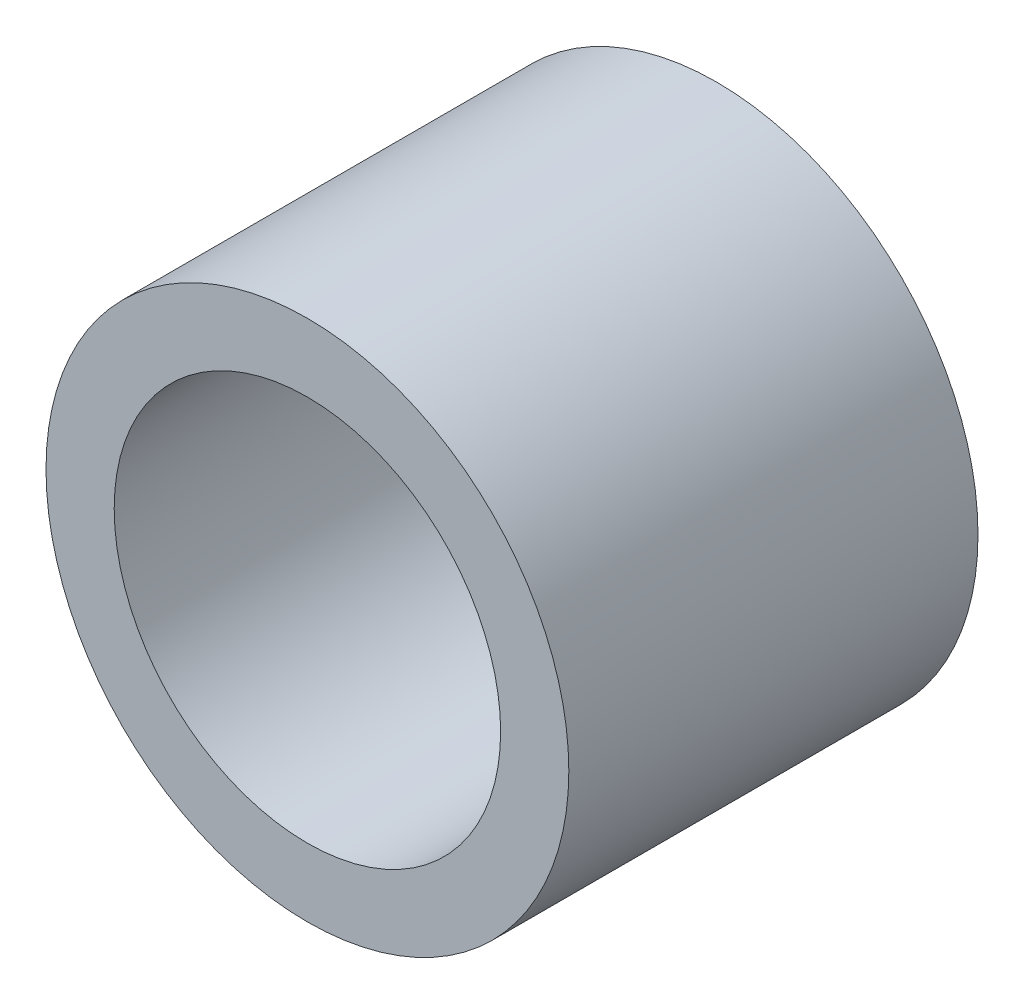
ISO-10303-21;
HEADER;
FILE_DESCRIPTION(('STEP AP214'),'2;1');
FILE_NAME('part.step','',(''),(''),'','','');
FILE_SCHEMA(('AUTOMOTIVE_DESIGN { 1 0 10303 214 1 1 1 1 }'));
ENDSEC;
DATA;
#1=APPLICATION_CONTEXT('core data for automotive mechanical design processes');
#2=APPLICATION_PROTOCOL_DEFINITION('international standard','automotive_design',2000,#1);
#3=PRODUCT_CONTEXT('',#1,'mechanical');
#4=PRODUCT('Part','Part','',(#3));
#5=PRODUCT_RELATED_PRODUCT_CATEGORY('part','',(#4));
#6=PRODUCT_DEFINITION_FORMATION('','',#4);
#7=PRODUCT_DEFINITION_CONTEXT('part definition',#1,'design');
#8=PRODUCT_DEFINITION('design','',#6,#7);
#9=PRODUCT_DEFINITION_SHAPE('','',#8);
#10=(LENGTH_UNIT() NAMED_UNIT(*) SI_UNIT(.MILLI.,.METRE.));
#11=(NAMED_UNIT(*) PLANE_ANGLE_UNIT() SI_UNIT($,.RADIAN.));
#12=(NAMED_UNIT(*) SI_UNIT($,.STERADIAN.) SOLID_ANGLE_UNIT());
#13=UNCERTAINTY_MEASURE_WITH_UNIT(LENGTH_MEASURE(1.E-05),#10,'distance_accuracy_value','');
#14=(GEOMETRIC_REPRESENTATION_CONTEXT(3) GLOBAL_UNCERTAINTY_ASSIGNED_CONTEXT((#13)) GLOBAL_UNIT_ASSIGNED_CONTEXT((#10,
#11,#12)) REPRESENTATION_CONTEXT('',''));
#15=CARTESIAN_POINT('',(0.,0.,0.));
#16=DIRECTION('',(0.,0.,1.));
#17=DIRECTION('',(1.,0.,0.));
#18=AXIS2_PLACEMENT_3D('',#15,#16,#17);
#19=CARTESIAN_POINT('',(0.,0.,-18.));
#20=DIRECTION('',(0.,0.,-1.));
#21=DIRECTION('',(1.,0.,0.));
#22=AXIS2_PLACEMENT_3D('',#19,#20,#21);
#23=PLANE('',#22);
#24=CARTESIAN_POINT('',(0.,0.,-18.));
#25=DIRECTION('',(0.,0.,1.));
#26=DIRECTION('',(1.,0.,0.));
#27=AXIS2_PLACEMENT_3D('',#24,#25,#26);
#28=CIRCLE('',#27,11.5);
#29=CARTESIAN_POINT('',(11.5,0.,-18.));
#30=VERTEX_POINT('',#29);
#31=EDGE_CURVE('E10',#30,#30,#28,.T.);
#32=ORIENTED_EDGE('',*,*,#31,.F.);
#33=EDGE_LOOP('',(#32));
#34=FACE_BOUND('',#33,.T.);
#35=CARTESIAN_POINT('',(0.,0.,-18.));
#36=DIRECTION('',(0.,0.,1.));
#37=DIRECTION('',(1.,0.,0.));
#38=AXIS2_PLACEMENT_3D('',#35,#36,#37);
#39=CIRCLE('',#38,8.5);
#40=CARTESIAN_POINT('',(8.5,0.,-18.));
#41=VERTEX_POINT('',#40);
#42=EDGE_CURVE('E56',#41,#41,#39,.T.);
#43=ORIENTED_EDGE('',*,*,#42,.T.);
#44=EDGE_LOOP('',(#43));
#45=FACE_BOUND('',#44,.T.);
#46=ADVANCED_FACE('F43',(#34,#45),#23,.T.);
#47=CARTESIAN_POINT('',(0.,0.,0.));
#48=DIRECTION('',(0.,0.,-1.));
#49=DIRECTION('',(1.,0.,0.));
#50=AXIS2_PLACEMENT_3D('',#47,#48,#49);
#51=PLANE('',#50);
#52=CARTESIAN_POINT('',(0.,0.,0.));
#53=DIRECTION('',(0.,0.,1.));
#54=DIRECTION('',(1.,0.,0.));
#55=AXIS2_PLACEMENT_3D('',#52,#53,#54);
#56=CIRCLE('',#55,11.5);
#57=CARTESIAN_POINT('',(11.5,0.,0.));
#58=VERTEX_POINT('',#57);
#59=EDGE_CURVE('E47',#58,#58,#56,.T.);
#60=ORIENTED_EDGE('',*,*,#59,.T.);
#61=EDGE_LOOP('',(#60));
#62=FACE_BOUND('',#61,.T.);
#63=CARTESIAN_POINT('',(0.,0.,0.));
#64=DIRECTION('',(0.,0.,1.));
#65=DIRECTION('',(1.,0.,0.));
#66=AXIS2_PLACEMENT_3D('',#63,#64,#65);
#67=CIRCLE('',#66,8.5);
#68=CARTESIAN_POINT('',(8.5,0.,0.));
#69=VERTEX_POINT('',#68);
#70=EDGE_CURVE('E58',#69,#69,#67,.T.);
#71=ORIENTED_EDGE('',*,*,#70,.F.);
#72=EDGE_LOOP('',(#71));
#73=FACE_BOUND('',#72,.T.);
#74=ADVANCED_FACE('F73',(#62,#73),#51,.F.);
#75=CARTESIAN_POINT('',(0.,0.,-18.));
#76=DIRECTION('',(0.,0.,1.));
#77=DIRECTION('',(-1.,0.,0.));
#78=AXIS2_PLACEMENT_3D('',#75,#76,#77);
#79=CYLINDRICAL_SURFACE('',#78,11.5);
#80=ORIENTED_EDGE('',*,*,#31,.T.);
#81=EDGE_LOOP('',(#80));
#82=FACE_BOUND('',#81,.T.);
#83=ORIENTED_EDGE('',*,*,#59,.F.);
#84=EDGE_LOOP('',(#83));
#85=FACE_BOUND('',#84,.T.);
#86=ADVANCED_FACE('F45',(#82,#85),#79,.T.);
#87=CARTESIAN_POINT('',(0.,0.,-18.));
#88=DIRECTION('',(0.,0.,1.));
#89=DIRECTION('',(-1.,0.,0.));
#90=AXIS2_PLACEMENT_3D('',#87,#88,#89);
#91=CYLINDRICAL_SURFACE('',#90,8.5);
#92=ORIENTED_EDGE('',*,*,#42,.F.);
#93=EDGE_LOOP('',(#92));
#94=FACE_BOUND('',#93,.T.);
#95=ORIENTED_EDGE('',*,*,#70,.T.);
#96=EDGE_LOOP('',(#95));
#97=FACE_BOUND('',#96,.T.);
#98=ADVANCED_FACE('F67',(#94,#97),#91,.F.);
#99=CLOSED_SHELL('',(#46,#74,#86,#98));
#100=MANIFOLD_SOLID_BREP('B2',#99);
#101=ADVANCED_BREP_SHAPE_REPRESENTATION('',(#18,#100),#14);
#102=SHAPE_DEFINITION_REPRESENTATION(#9,#101);
ENDSEC;
END-ISO-10303-21;
